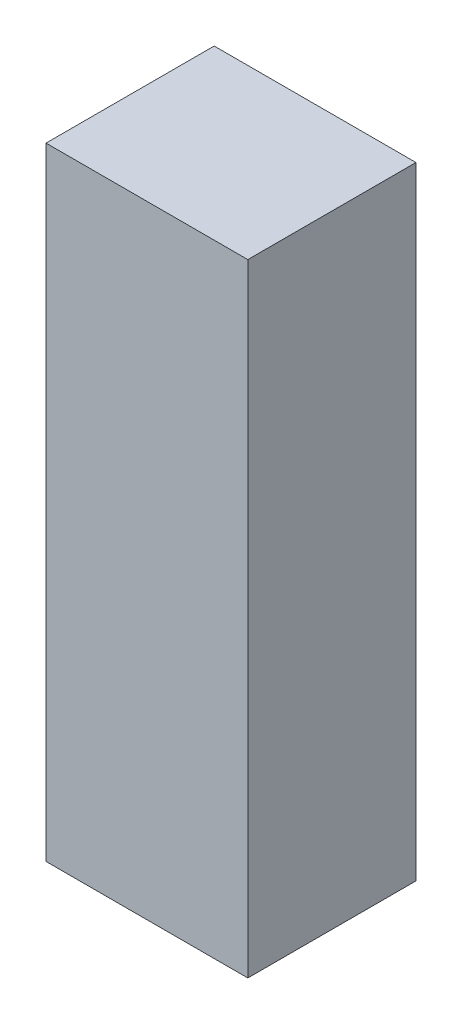
ISO-10303-21;
HEADER;
FILE_DESCRIPTION(('STEP AP214'),'2;1');
FILE_NAME('part.step','',(''),(''),'','','');
FILE_SCHEMA(('AUTOMOTIVE_DESIGN { 1 0 10303 214 1 1 1 1 }'));
ENDSEC;
DATA;
#1=APPLICATION_CONTEXT('core data for automotive mechanical design processes');
#2=APPLICATION_PROTOCOL_DEFINITION('international standard','automotive_design',2000,#1);
#3=PRODUCT_CONTEXT('',#1,'mechanical');
#4=PRODUCT('Part','Part','',(#3));
#5=PRODUCT_RELATED_PRODUCT_CATEGORY('part','',(#4));
#6=PRODUCT_DEFINITION_FORMATION('','',#4);
#7=PRODUCT_DEFINITION_CONTEXT('part definition',#1,'design');
#8=PRODUCT_DEFINITION('design','',#6,#7);
#9=PRODUCT_DEFINITION_SHAPE('','',#8);
#10=(LENGTH_UNIT() NAMED_UNIT(*) SI_UNIT(.MILLI.,.METRE.));
#11=(NAMED_UNIT(*) PLANE_ANGLE_UNIT() SI_UNIT($,.RADIAN.));
#12=(NAMED_UNIT(*) SI_UNIT($,.STERADIAN.) SOLID_ANGLE_UNIT());
#13=UNCERTAINTY_MEASURE_WITH_UNIT(LENGTH_MEASURE(1.E-05),#10,'distance_accuracy_value','');
#14=(GEOMETRIC_REPRESENTATION_CONTEXT(3) GLOBAL_UNCERTAINTY_ASSIGNED_CONTEXT((#13)) GLOBAL_UNIT_ASSIGNED_CONTEXT((#10,
#11,#12)) REPRESENTATION_CONTEXT('',''));
#15=CARTESIAN_POINT('',(0.,0.,0.));
#16=DIRECTION('',(0.,0.,1.));
#17=DIRECTION('',(1.,0.,0.));
#18=AXIS2_PLACEMENT_3D('',#15,#16,#17);
#19=CARTESIAN_POINT('',(0.24,0.115,0.));
#20=DIRECTION('',(1.,0.,0.));
#21=DIRECTION('',(0.,0.,1.));
#22=AXIS2_PLACEMENT_3D('',#19,#20,#21);
#23=PLANE('',#22);
#24=DIRECTION('',(0.,1.,0.));
#25=VECTOR('',#24,1.);
#26=CARTESIAN_POINT('',(0.24,0.115,0.1));
#27=LINE('',#26,#25);
#28=CARTESIAN_POINT('',(0.24,0.115,0.1));
#29=VERTEX_POINT('',#28);
#30=CARTESIAN_POINT('',(0.24,0.485,0.1));
#31=VERTEX_POINT('',#30);
#32=EDGE_CURVE('E11',#29,#31,#27,.T.);
#33=ORIENTED_EDGE('',*,*,#32,.T.);
#34=DIRECTION('',(0.,0.,1.));
#35=VECTOR('',#34,1.);
#36=CARTESIAN_POINT('',(0.24,0.485,0.));
#37=LINE('',#36,#35);
#38=CARTESIAN_POINT('',(0.24,0.485,0.));
#39=VERTEX_POINT('',#38);
#40=EDGE_CURVE('E24',#39,#31,#37,.T.);
#41=ORIENTED_EDGE('',*,*,#40,.F.);
#42=DIRECTION('',(0.,1.,0.));
#43=VECTOR('',#42,1.);
#44=CARTESIAN_POINT('',(0.24,0.115,0.));
#45=LINE('',#44,#43);
#46=CARTESIAN_POINT('',(0.24,0.115,0.));
#47=VERTEX_POINT('',#46);
#48=EDGE_CURVE('E86',#47,#39,#45,.T.);
#49=ORIENTED_EDGE('',*,*,#48,.F.);
#50=DIRECTION('',(0.,0.,1.));
#51=VECTOR('',#50,1.);
#52=CARTESIAN_POINT('',(0.24,0.115,0.));
#53=LINE('',#52,#51);
#54=EDGE_CURVE('E36',#47,#29,#53,.T.);
#55=ORIENTED_EDGE('',*,*,#54,.T.);
#56=EDGE_LOOP('',(#33,#41,#49,#55));
#57=FACE_BOUND('',#56,.T.);
#58=ADVANCED_FACE('F17',(#57),#23,.F.);
#59=CARTESIAN_POINT('',(0.36,0.115,0.));
#60=DIRECTION('',(1.,0.,0.));
#61=DIRECTION('',(0.,0.,1.));
#62=AXIS2_PLACEMENT_3D('',#59,#60,#61);
#63=PLANE('',#62);
#64=DIRECTION('',(0.,0.,1.));
#65=VECTOR('',#64,1.);
#66=CARTESIAN_POINT('',(0.36,0.115,0.));
#67=LINE('',#66,#65);
#68=CARTESIAN_POINT('',(0.36,0.115,0.));
#69=VERTEX_POINT('',#68);
#70=CARTESIAN_POINT('',(0.36,0.115,0.1));
#71=VERTEX_POINT('',#70);
#72=EDGE_CURVE('E83',#69,#71,#67,.T.);
#73=ORIENTED_EDGE('',*,*,#72,.F.);
#74=DIRECTION('',(0.,1.,0.));
#75=VECTOR('',#74,1.);
#76=CARTESIAN_POINT('',(0.36,0.115,0.));
#77=LINE('',#76,#75);
#78=CARTESIAN_POINT('',(0.36,0.485,0.));
#79=VERTEX_POINT('',#78);
#80=EDGE_CURVE('E63',#69,#79,#77,.T.);
#81=ORIENTED_EDGE('',*,*,#80,.T.);
#82=DIRECTION('',(0.,0.,1.));
#83=VECTOR('',#82,1.);
#84=CARTESIAN_POINT('',(0.36,0.485,0.));
#85=LINE('',#84,#83);
#86=CARTESIAN_POINT('',(0.36,0.485,0.1));
#87=VERTEX_POINT('',#86);
#88=EDGE_CURVE('E57',#79,#87,#85,.T.);
#89=ORIENTED_EDGE('',*,*,#88,.T.);
#90=DIRECTION('',(0.,1.,0.));
#91=VECTOR('',#90,1.);
#92=CARTESIAN_POINT('',(0.36,0.115,0.1));
#93=LINE('',#92,#91);
#94=EDGE_CURVE('E60',#71,#87,#93,.T.);
#95=ORIENTED_EDGE('',*,*,#94,.F.);
#96=EDGE_LOOP('',(#73,#81,#89,#95));
#97=FACE_BOUND('',#96,.T.);
#98=ADVANCED_FACE('F59',(#97),#63,.T.);
#99=CARTESIAN_POINT('',(0.24,0.115,0.));
#100=DIRECTION('',(0.,1.,0.));
#101=DIRECTION('',(0.,0.,1.));
#102=AXIS2_PLACEMENT_3D('',#99,#100,#101);
#103=PLANE('',#102);
#104=ORIENTED_EDGE('',*,*,#72,.T.);
#105=DIRECTION('',(1.,0.,0.));
#106=VECTOR('',#105,1.);
#107=CARTESIAN_POINT('',(0.24,0.115,0.1));
#108=LINE('',#107,#106);
#109=EDGE_CURVE('E71',#29,#71,#108,.T.);
#110=ORIENTED_EDGE('',*,*,#109,.F.);
#111=ORIENTED_EDGE('',*,*,#54,.F.);
#112=DIRECTION('',(1.,0.,0.));
#113=VECTOR('',#112,1.);
#114=CARTESIAN_POINT('',(0.24,0.115,0.));
#115=LINE('',#114,#113);
#116=EDGE_CURVE('E76',#47,#69,#115,.T.);
#117=ORIENTED_EDGE('',*,*,#116,.T.);
#118=EDGE_LOOP('',(#104,#110,#111,#117));
#119=FACE_BOUND('',#118,.T.);
#120=ADVANCED_FACE('F91',(#119),#103,.F.);
#121=CARTESIAN_POINT('',(0.24,0.485,0.));
#122=DIRECTION('',(0.,1.,0.));
#123=DIRECTION('',(0.,0.,1.));
#124=AXIS2_PLACEMENT_3D('',#121,#122,#123);
#125=PLANE('',#124);
#126=DIRECTION('',(1.,0.,0.));
#127=VECTOR('',#126,1.);
#128=CARTESIAN_POINT('',(0.24,0.485,0.));
#129=LINE('',#128,#127);
#130=EDGE_CURVE('E74',#39,#79,#129,.T.);
#131=ORIENTED_EDGE('',*,*,#130,.F.);
#132=ORIENTED_EDGE('',*,*,#40,.T.);
#133=DIRECTION('',(1.,0.,0.));
#134=VECTOR('',#133,1.);
#135=CARTESIAN_POINT('',(0.24,0.485,0.1));
#136=LINE('',#135,#134);
#137=EDGE_CURVE('E69',#31,#87,#136,.T.);
#138=ORIENTED_EDGE('',*,*,#137,.T.);
#139=ORIENTED_EDGE('',*,*,#88,.F.);
#140=EDGE_LOOP('',(#131,#132,#138,#139));
#141=FACE_BOUND('',#140,.T.);
#142=ADVANCED_FACE('F73',(#141),#125,.T.);
#143=CARTESIAN_POINT('',(0.24,0.115,0.));
#144=DIRECTION('',(0.,0.,1.));
#145=DIRECTION('',(1.,0.,0.));
#146=AXIS2_PLACEMENT_3D('',#143,#144,#145);
#147=PLANE('',#146);
#148=ORIENTED_EDGE('',*,*,#130,.T.);
#149=ORIENTED_EDGE('',*,*,#80,.F.);
#150=ORIENTED_EDGE('',*,*,#116,.F.);
#151=ORIENTED_EDGE('',*,*,#48,.T.);
#152=EDGE_LOOP('',(#148,#149,#150,#151));
#153=FACE_BOUND('',#152,.T.);
#154=ADVANCED_FACE('F89',(#153),#147,.F.);
#155=CARTESIAN_POINT('',(0.24,0.115,0.1));
#156=DIRECTION('',(0.,0.,1.));
#157=DIRECTION('',(1.,0.,0.));
#158=AXIS2_PLACEMENT_3D('',#155,#156,#157);
#159=PLANE('',#158);
#160=ORIENTED_EDGE('',*,*,#32,.F.);
#161=ORIENTED_EDGE('',*,*,#109,.T.);
#162=ORIENTED_EDGE('',*,*,#94,.T.);
#163=ORIENTED_EDGE('',*,*,#137,.F.);
#164=EDGE_LOOP('',(#160,#161,#162,#163));
#165=FACE_BOUND('',#164,.T.);
#166=ADVANCED_FACE('F68',(#165),#159,.T.);
#167=CLOSED_SHELL('',(#58,#98,#120,#142,#154,#166));
#168=MANIFOLD_SOLID_BREP('B1',#167);
#169=ADVANCED_BREP_SHAPE_REPRESENTATION('',(#18,#168),#14);
#170=SHAPE_DEFINITION_REPRESENTATION(#9,#169);
ENDSEC;
END-ISO-10303-21;
